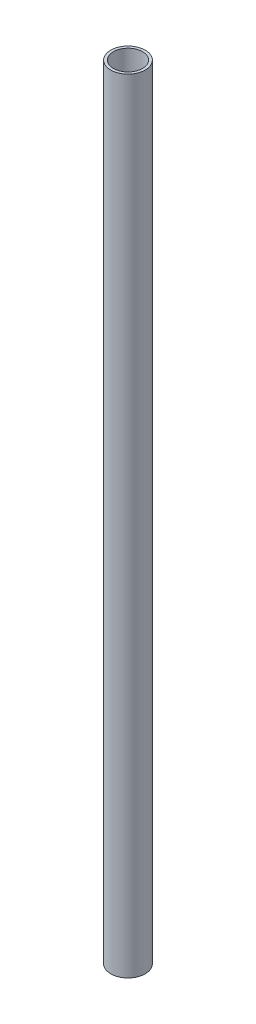
ISO-10303-21;
HEADER;
FILE_DESCRIPTION(('STEP AP214'),'2;1');
FILE_NAME('part.step','',(''),(''),'','','');
FILE_SCHEMA(('AUTOMOTIVE_DESIGN { 1 0 10303 214 1 1 1 1 }'));
ENDSEC;
DATA;
#1=APPLICATION_CONTEXT('core data for automotive mechanical design processes');
#2=APPLICATION_PROTOCOL_DEFINITION('international standard','automotive_design',2000,#1);
#3=PRODUCT_CONTEXT('',#1,'mechanical');
#4=PRODUCT('Part','Part','',(#3));
#5=PRODUCT_RELATED_PRODUCT_CATEGORY('part','',(#4));
#6=PRODUCT_DEFINITION_FORMATION('','',#4);
#7=PRODUCT_DEFINITION_CONTEXT('part definition',#1,'design');
#8=PRODUCT_DEFINITION('design','',#6,#7);
#9=PRODUCT_DEFINITION_SHAPE('','',#8);
#10=(LENGTH_UNIT() NAMED_UNIT(*) SI_UNIT(.MILLI.,.METRE.));
#11=(NAMED_UNIT(*) PLANE_ANGLE_UNIT() SI_UNIT($,.RADIAN.));
#12=(NAMED_UNIT(*) SI_UNIT($,.STERADIAN.) SOLID_ANGLE_UNIT());
#13=UNCERTAINTY_MEASURE_WITH_UNIT(LENGTH_MEASURE(1.E-05),#10,'distance_accuracy_value','');
#14=(GEOMETRIC_REPRESENTATION_CONTEXT(3) GLOBAL_UNCERTAINTY_ASSIGNED_CONTEXT((#13)) GLOBAL_UNIT_ASSIGNED_CONTEXT((#10,
#11,#12)) REPRESENTATION_CONTEXT('',''));
#15=CARTESIAN_POINT('',(0.,0.,0.));
#16=DIRECTION('',(0.,0.,1.));
#17=DIRECTION('',(1.,0.,0.));
#18=AXIS2_PLACEMENT_3D('',#15,#16,#17);
#19=CARTESIAN_POINT('',(0.,590.,0.));
#20=DIRECTION('',(0.,1.,0.));
#21=DIRECTION('',(0.,0.,1.));
#22=AXIS2_PLACEMENT_3D('',#19,#20,#21);
#23=PLANE('',#22);
#24=CARTESIAN_POINT('',(0.,590.,0.));
#25=DIRECTION('',(0.,1.,0.));
#26=DIRECTION('',(0.,0.,1.));
#27=AXIS2_PLACEMENT_3D('',#24,#25,#26);
#28=CIRCLE('',#27,13.);
#29=CARTESIAN_POINT('',(0.,590.,13.));
#30=VERTEX_POINT('',#29);
#31=EDGE_CURVE('E10',#30,#30,#28,.T.);
#32=ORIENTED_EDGE('',*,*,#31,.T.);
#33=EDGE_LOOP('',(#32));
#34=FACE_BOUND('',#33,.T.);
#35=CARTESIAN_POINT('',(0.,590.,0.));
#36=DIRECTION('',(0.,1.,0.));
#37=DIRECTION('',(0.,0.,1.));
#38=AXIS2_PLACEMENT_3D('',#35,#36,#37);
#39=CIRCLE('',#38,11.);
#40=CARTESIAN_POINT('',(0.,590.,11.));
#41=VERTEX_POINT('',#40);
#42=EDGE_CURVE('E45',#41,#41,#39,.T.);
#43=ORIENTED_EDGE('',*,*,#42,.F.);
#44=EDGE_LOOP('',(#43));
#45=FACE_BOUND('',#44,.T.);
#46=ADVANCED_FACE('F34',(#34,#45),#23,.T.);
#47=CARTESIAN_POINT('',(0.,0.,0.));
#48=DIRECTION('',(0.,1.,0.));
#49=DIRECTION('',(0.,0.,1.));
#50=AXIS2_PLACEMENT_3D('',#47,#48,#49);
#51=PLANE('',#50);
#52=CARTESIAN_POINT('',(0.,0.,0.));
#53=DIRECTION('',(0.,1.,0.));
#54=DIRECTION('',(0.,0.,1.));
#55=AXIS2_PLACEMENT_3D('',#52,#53,#54);
#56=CIRCLE('',#55,13.);
#57=CARTESIAN_POINT('',(0.,0.,13.));
#58=VERTEX_POINT('',#57);
#59=EDGE_CURVE('E38',#58,#58,#56,.T.);
#60=ORIENTED_EDGE('',*,*,#59,.F.);
#61=EDGE_LOOP('',(#60));
#62=FACE_BOUND('',#61,.T.);
#63=CARTESIAN_POINT('',(0.,0.,0.));
#64=DIRECTION('',(0.,1.,0.));
#65=DIRECTION('',(0.,0.,1.));
#66=AXIS2_PLACEMENT_3D('',#63,#64,#65);
#67=CIRCLE('',#66,11.);
#68=CARTESIAN_POINT('',(0.,0.,11.));
#69=VERTEX_POINT('',#68);
#70=EDGE_CURVE('E47',#69,#69,#67,.T.);
#71=ORIENTED_EDGE('',*,*,#70,.T.);
#72=EDGE_LOOP('',(#71));
#73=FACE_BOUND('',#72,.T.);
#74=ADVANCED_FACE('F57',(#62,#73),#51,.F.);
#75=CARTESIAN_POINT('',(0.,590.,0.));
#76=DIRECTION('',(0.,-1.,0.));
#77=DIRECTION('',(0.,0.,-1.));
#78=AXIS2_PLACEMENT_3D('',#75,#76,#77);
#79=CYLINDRICAL_SURFACE('',#78,13.);
#80=ORIENTED_EDGE('',*,*,#31,.F.);
#81=EDGE_LOOP('',(#80));
#82=FACE_BOUND('',#81,.T.);
#83=ORIENTED_EDGE('',*,*,#59,.T.);
#84=EDGE_LOOP('',(#83));
#85=FACE_BOUND('',#84,.T.);
#86=ADVANCED_FACE('F36',(#82,#85),#79,.T.);
#87=CARTESIAN_POINT('',(0.,590.,0.));
#88=DIRECTION('',(0.,-1.,0.));
#89=DIRECTION('',(0.,0.,-1.));
#90=AXIS2_PLACEMENT_3D('',#87,#88,#89);
#91=CYLINDRICAL_SURFACE('',#90,11.);
#92=ORIENTED_EDGE('',*,*,#42,.T.);
#93=EDGE_LOOP('',(#92));
#94=FACE_BOUND('',#93,.T.);
#95=ORIENTED_EDGE('',*,*,#70,.F.);
#96=EDGE_LOOP('',(#95));
#97=FACE_BOUND('',#96,.T.);
#98=ADVANCED_FACE('F53',(#94,#97),#91,.F.);
#99=CLOSED_SHELL('',(#46,#74,#86,#98));
#100=MANIFOLD_SOLID_BREP('B2',#99);
#101=ADVANCED_BREP_SHAPE_REPRESENTATION('',(#18,#100),#14);
#102=SHAPE_DEFINITION_REPRESENTATION(#9,#101);
ENDSEC;
END-ISO-10303-21;
